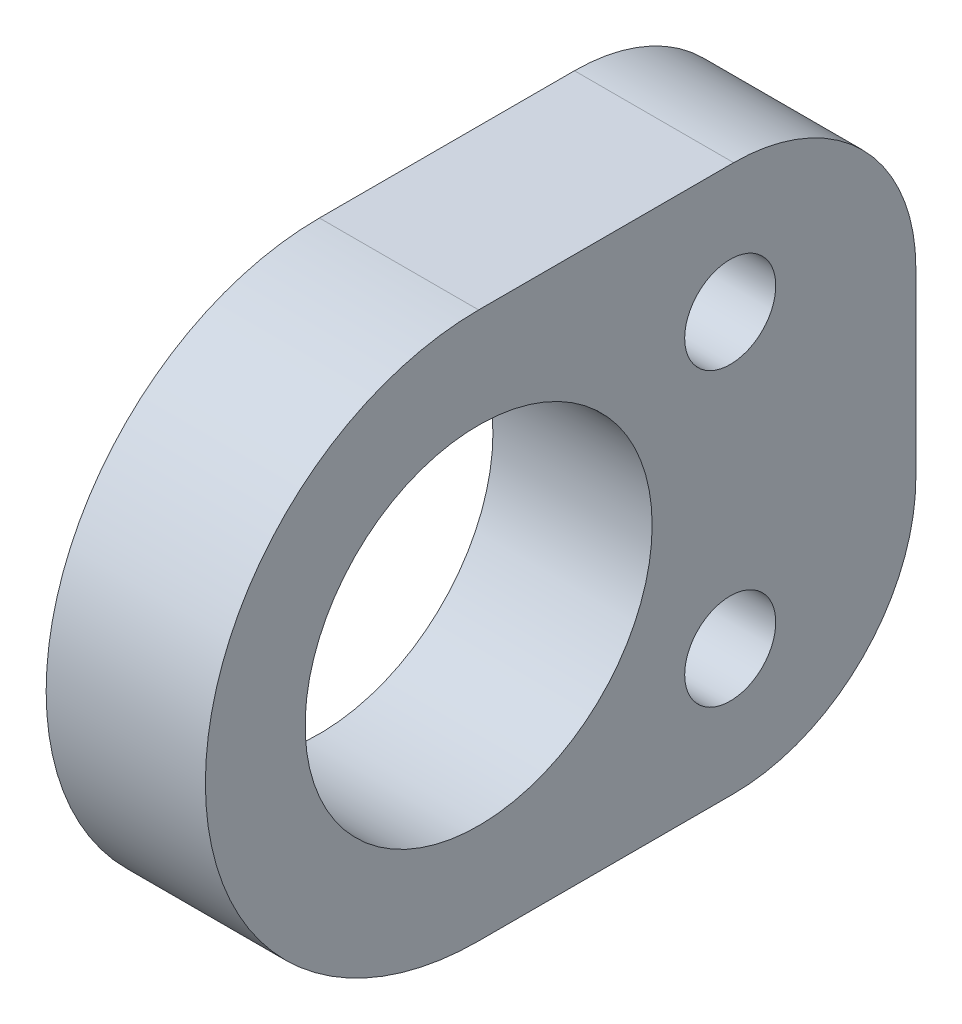
ISO-10303-21;
HEADER;
FILE_DESCRIPTION(('STEP AP214'),'2;1');
FILE_NAME('part.step','',(''),(''),'','','');
FILE_SCHEMA(('AUTOMOTIVE_DESIGN { 1 0 10303 214 1 1 1 1 }'));
ENDSEC;
DATA;
#1=APPLICATION_CONTEXT('core data for automotive mechanical design processes');
#2=APPLICATION_PROTOCOL_DEFINITION('international standard','automotive_design',2000,#1);
#3=PRODUCT_CONTEXT('',#1,'mechanical');
#4=PRODUCT('Part','Part','',(#3));
#5=PRODUCT_RELATED_PRODUCT_CATEGORY('part','',(#4));
#6=PRODUCT_DEFINITION_FORMATION('','',#4);
#7=PRODUCT_DEFINITION_CONTEXT('part definition',#1,'design');
#8=PRODUCT_DEFINITION('design','',#6,#7);
#9=PRODUCT_DEFINITION_SHAPE('','',#8);
#10=(LENGTH_UNIT() NAMED_UNIT(*) SI_UNIT(.MILLI.,.METRE.));
#11=(NAMED_UNIT(*) PLANE_ANGLE_UNIT() SI_UNIT($,.RADIAN.));
#12=(NAMED_UNIT(*) SI_UNIT($,.STERADIAN.) SOLID_ANGLE_UNIT());
#13=UNCERTAINTY_MEASURE_WITH_UNIT(LENGTH_MEASURE(1.E-05),#10,'distance_accuracy_value','');
#14=(GEOMETRIC_REPRESENTATION_CONTEXT(3) GLOBAL_UNCERTAINTY_ASSIGNED_CONTEXT((#13)) GLOBAL_UNIT_ASSIGNED_CONTEXT((#10,
#11,#12)) REPRESENTATION_CONTEXT('',''));
#15=CARTESIAN_POINT('',(0.,0.,0.));
#16=DIRECTION('',(0.,0.,1.));
#17=DIRECTION('',(1.,0.,0.));
#18=AXIS2_PLACEMENT_3D('',#15,#16,#17);
#19=CARTESIAN_POINT('',(4.37,0.,0.));
#20=DIRECTION('',(1.,0.,0.));
#21=DIRECTION('',(0.,0.,-1.));
#22=AXIS2_PLACEMENT_3D('',#19,#20,#21);
#23=PLANE('',#22);
#24=CARTESIAN_POINT('',(4.37,4.,-6.9050995648144));
#25=DIRECTION('',(-1.,0.,0.));
#26=DIRECTION('',(0.,0.,1.));
#27=AXIS2_PLACEMENT_3D('',#24,#25,#26);
#28=CIRCLE('',#27,1.25);
#29=CARTESIAN_POINT('',(4.37,4.,-5.6550995648144));
#30=VERTEX_POINT('',#29);
#31=EDGE_CURVE('E205',#30,#30,#28,.T.);
#32=ORIENTED_EDGE('',*,*,#31,.T.);
#33=EDGE_LOOP('',(#32));
#34=FACE_BOUND('',#33,.T.);
#35=CARTESIAN_POINT('',(4.37,-4.,-6.9050995648144));
#36=DIRECTION('',(-1.,0.,0.));
#37=DIRECTION('',(0.,0.,1.));
#38=AXIS2_PLACEMENT_3D('',#35,#36,#37);
#39=CIRCLE('',#38,1.25);
#40=CARTESIAN_POINT('',(4.37,-4.,-5.6550995648144));
#41=VERTEX_POINT('',#40);
#42=EDGE_CURVE('E194',#41,#41,#39,.T.);
#43=ORIENTED_EDGE('',*,*,#42,.T.);
#44=EDGE_LOOP('',(#43));
#45=FACE_BOUND('',#44,.T.);
#46=DIRECTION('',(0.,0.,1.));
#47=VECTOR('',#46,1.);
#48=CARTESIAN_POINT('',(4.37,-7.5,-12.));
#49=LINE('',#48,#47);
#50=CARTESIAN_POINT('',(4.37,-7.5,-7.));
#51=VERTEX_POINT('',#50);
#52=CARTESIAN_POINT('',(4.37,-7.5,0.));
#53=VERTEX_POINT('',#52);
#54=EDGE_CURVE('E117',#51,#53,#49,.T.);
#55=ORIENTED_EDGE('',*,*,#54,.F.);
#56=CARTESIAN_POINT('',(4.37,-2.5,-7.));
#57=DIRECTION('',(1.,0.,0.));
#58=DIRECTION('',(0.,0.,-1.));
#59=AXIS2_PLACEMENT_3D('',#56,#57,#58);
#60=CIRCLE('',#59,5.);
#61=CARTESIAN_POINT('',(4.37,-2.5,-12.));
#62=VERTEX_POINT('',#61);
#63=EDGE_CURVE('E71',#51,#62,#60,.T.);
#64=ORIENTED_EDGE('',*,*,#63,.T.);
#65=DIRECTION('',(0.,-1.,0.));
#66=VECTOR('',#65,1.);
#67=CARTESIAN_POINT('',(4.37,7.5,-12.));
#68=LINE('',#67,#66);
#69=CARTESIAN_POINT('',(4.37,2.5,-12.));
#70=VERTEX_POINT('',#69);
#71=EDGE_CURVE('E126',#70,#62,#68,.T.);
#72=ORIENTED_EDGE('',*,*,#71,.F.);
#73=CARTESIAN_POINT('',(4.37,2.5,-7.));
#74=DIRECTION('',(1.,0.,0.));
#75=DIRECTION('',(0.,0.,-1.));
#76=AXIS2_PLACEMENT_3D('',#73,#74,#75);
#77=CIRCLE('',#76,5.);
#78=CARTESIAN_POINT('',(4.37,7.5,-7.));
#79=VERTEX_POINT('',#78);
#80=EDGE_CURVE('E78',#70,#79,#77,.T.);
#81=ORIENTED_EDGE('',*,*,#80,.T.);
#82=DIRECTION('',(0.,0.,-1.));
#83=VECTOR('',#82,1.);
#84=CARTESIAN_POINT('',(4.37,7.5,0.));
#85=LINE('',#84,#83);
#86=CARTESIAN_POINT('',(4.37,7.5,0.));
#87=VERTEX_POINT('',#86);
#88=EDGE_CURVE('E130',#87,#79,#85,.T.);
#89=ORIENTED_EDGE('',*,*,#88,.F.);
#90=CARTESIAN_POINT('',(4.37,0.,0.));
#91=DIRECTION('',(1.,0.,0.));
#92=DIRECTION('',(0.,0.,-1.));
#93=AXIS2_PLACEMENT_3D('',#90,#91,#92);
#94=CIRCLE('',#93,7.5);
#95=EDGE_CURVE('E125',#87,#53,#94,.T.);
#96=ORIENTED_EDGE('',*,*,#95,.T.);
#97=EDGE_LOOP('',(#55,#64,#72,#81,#89,#96));
#98=FACE_BOUND('',#97,.T.);
#99=CARTESIAN_POINT('',(4.37,0.,0.));
#100=DIRECTION('',(1.,0.,0.));
#101=DIRECTION('',(0.,0.,-1.));
#102=AXIS2_PLACEMENT_3D('',#99,#100,#101);
#103=CIRCLE('',#102,4.7625);
#104=CARTESIAN_POINT('',(4.37,0.,-4.7625));
#105=VERTEX_POINT('',#104);
#106=EDGE_CURVE('E186',#105,#105,#103,.T.);
#107=ORIENTED_EDGE('',*,*,#106,.F.);
#108=EDGE_LOOP('',(#107));
#109=FACE_BOUND('',#108,.T.);
#110=ADVANCED_FACE('F62',(#34,#45,#98,#109),#23,.T.);
#111=CARTESIAN_POINT('',(0.,0.,0.));
#112=DIRECTION('',(1.,0.,0.));
#113=DIRECTION('',(0.,0.,-1.));
#114=AXIS2_PLACEMENT_3D('',#111,#112,#113);
#115=PLANE('',#114);
#116=CARTESIAN_POINT('',(0.,4.,-6.9050995648144));
#117=DIRECTION('',(-1.,0.,0.));
#118=DIRECTION('',(0.,0.,1.));
#119=AXIS2_PLACEMENT_3D('',#116,#117,#118);
#120=CIRCLE('',#119,1.24999999999999);
#121=CARTESIAN_POINT('',(0.,4.,-5.65509956481441));
#122=VERTEX_POINT('',#121);
#123=EDGE_CURVE('E209',#122,#122,#120,.T.);
#124=ORIENTED_EDGE('',*,*,#123,.F.);
#125=EDGE_LOOP('',(#124));
#126=FACE_BOUND('',#125,.T.);
#127=CARTESIAN_POINT('',(0.,-4.,-6.9050995648144));
#128=DIRECTION('',(-1.,0.,0.));
#129=DIRECTION('',(0.,0.,1.));
#130=AXIS2_PLACEMENT_3D('',#127,#128,#129);
#131=CIRCLE('',#130,1.24999999999999);
#132=CARTESIAN_POINT('',(0.,-4.,-5.65509956481441));
#133=VERTEX_POINT('',#132);
#134=EDGE_CURVE('E201',#133,#133,#131,.T.);
#135=ORIENTED_EDGE('',*,*,#134,.F.);
#136=EDGE_LOOP('',(#135));
#137=FACE_BOUND('',#136,.T.);
#138=DIRECTION('',(0.,-1.,0.));
#139=VECTOR('',#138,1.);
#140=CARTESIAN_POINT('',(0.,7.5,-12.));
#141=LINE('',#140,#139);
#142=CARTESIAN_POINT('',(0.,2.5,-12.));
#143=VERTEX_POINT('',#142);
#144=CARTESIAN_POINT('',(0.,-2.5,-12.));
#145=VERTEX_POINT('',#144);
#146=EDGE_CURVE('E176',#143,#145,#141,.T.);
#147=ORIENTED_EDGE('',*,*,#146,.T.);
#148=CARTESIAN_POINT('',(0.,-2.5,-7.));
#149=DIRECTION('',(1.,0.,0.));
#150=DIRECTION('',(0.,0.,-1.));
#151=AXIS2_PLACEMENT_3D('',#148,#149,#150);
#152=CIRCLE('',#151,5.);
#153=CARTESIAN_POINT('',(0.,-7.5,-7.));
#154=VERTEX_POINT('',#153);
#155=EDGE_CURVE('E154',#145,#154,#152,.F.);
#156=ORIENTED_EDGE('',*,*,#155,.T.);
#157=DIRECTION('',(0.,0.,1.));
#158=VECTOR('',#157,1.);
#159=CARTESIAN_POINT('',(0.,-7.5,-12.));
#160=LINE('',#159,#158);
#161=CARTESIAN_POINT('',(0.,-7.5,0.));
#162=VERTEX_POINT('',#161);
#163=EDGE_CURVE('E175',#154,#162,#160,.T.);
#164=ORIENTED_EDGE('',*,*,#163,.T.);
#165=CARTESIAN_POINT('',(0.,0.,0.));
#166=DIRECTION('',(1.,0.,0.));
#167=DIRECTION('',(0.,0.,-1.));
#168=AXIS2_PLACEMENT_3D('',#165,#166,#167);
#169=CIRCLE('',#168,7.5);
#170=CARTESIAN_POINT('',(0.,7.5,0.));
#171=VERTEX_POINT('',#170);
#172=EDGE_CURVE('E136',#171,#162,#169,.T.);
#173=ORIENTED_EDGE('',*,*,#172,.F.);
#174=DIRECTION('',(0.,0.,-1.));
#175=VECTOR('',#174,1.);
#176=CARTESIAN_POINT('',(0.,7.5,0.));
#177=LINE('',#176,#175);
#178=CARTESIAN_POINT('',(0.,7.5,-7.));
#179=VERTEX_POINT('',#178);
#180=EDGE_CURVE('E181',#171,#179,#177,.T.);
#181=ORIENTED_EDGE('',*,*,#180,.T.);
#182=CARTESIAN_POINT('',(0.,2.5,-7.));
#183=DIRECTION('',(1.,0.,0.));
#184=DIRECTION('',(0.,0.,-1.));
#185=AXIS2_PLACEMENT_3D('',#182,#183,#184);
#186=CIRCLE('',#185,5.);
#187=EDGE_CURVE('E151',#179,#143,#186,.F.);
#188=ORIENTED_EDGE('',*,*,#187,.T.);
#189=EDGE_LOOP('',(#147,#156,#164,#173,#181,#188));
#190=FACE_BOUND('',#189,.T.);
#191=CARTESIAN_POINT('',(0.,0.,0.));
#192=DIRECTION('',(1.,0.,0.));
#193=DIRECTION('',(0.,0.,-1.));
#194=AXIS2_PLACEMENT_3D('',#191,#192,#193);
#195=CIRCLE('',#194,4.7625);
#196=CARTESIAN_POINT('',(0.,0.,-4.7625));
#197=VERTEX_POINT('',#196);
#198=EDGE_CURVE('E190',#197,#197,#195,.T.);
#199=ORIENTED_EDGE('',*,*,#198,.T.);
#200=EDGE_LOOP('',(#199));
#201=FACE_BOUND('',#200,.T.);
#202=ADVANCED_FACE('F173',(#126,#137,#190,#201),#115,.F.);
#203=CARTESIAN_POINT('',(4.37,7.5,0.));
#204=DIRECTION('',(0.,1.,0.));
#205=DIRECTION('',(0.,0.,1.));
#206=AXIS2_PLACEMENT_3D('',#203,#204,#205);
#207=PLANE('',#206);
#208=ORIENTED_EDGE('',*,*,#88,.T.);
#209=DIRECTION('',(-1.,0.,0.));
#210=VECTOR('',#209,1.);
#211=CARTESIAN_POINT('',(4.37,7.5,-7.));
#212=LINE('',#211,#210);
#213=EDGE_CURVE('E12',#79,#179,#212,.T.);
#214=ORIENTED_EDGE('',*,*,#213,.T.);
#215=ORIENTED_EDGE('',*,*,#180,.F.);
#216=DIRECTION('',(-1.,0.,0.));
#217=VECTOR('',#216,1.);
#218=CARTESIAN_POINT('',(4.37,7.5,0.));
#219=LINE('',#218,#217);
#220=EDGE_CURVE('E138',#87,#171,#219,.T.);
#221=ORIENTED_EDGE('',*,*,#220,.F.);
#222=EDGE_LOOP('',(#208,#214,#215,#221));
#223=FACE_BOUND('',#222,.T.);
#224=ADVANCED_FACE('F218',(#223),#207,.T.);
#225=CARTESIAN_POINT('',(4.37,0.,0.));
#226=DIRECTION('',(-1.,0.,0.));
#227=DIRECTION('',(0.,0.,1.));
#228=AXIS2_PLACEMENT_3D('',#225,#226,#227);
#229=CYLINDRICAL_SURFACE('',#228,7.5);
#230=ORIENTED_EDGE('',*,*,#172,.T.);
#231=DIRECTION('',(-1.,0.,0.));
#232=VECTOR('',#231,1.);
#233=CARTESIAN_POINT('',(4.37,-7.5,0.));
#234=LINE('',#233,#232);
#235=EDGE_CURVE('E121',#53,#162,#234,.T.);
#236=ORIENTED_EDGE('',*,*,#235,.F.);
#237=ORIENTED_EDGE('',*,*,#95,.F.);
#238=ORIENTED_EDGE('',*,*,#220,.T.);
#239=EDGE_LOOP('',(#230,#236,#237,#238));
#240=FACE_BOUND('',#239,.T.);
#241=ADVANCED_FACE('F134',(#240),#229,.T.);
#242=CARTESIAN_POINT('',(4.37,-7.5,-12.));
#243=DIRECTION('',(0.,-1.,0.));
#244=DIRECTION('',(0.,0.,-1.));
#245=AXIS2_PLACEMENT_3D('',#242,#243,#244);
#246=PLANE('',#245);
#247=ORIENTED_EDGE('',*,*,#163,.F.);
#248=DIRECTION('',(-1.,0.,0.));
#249=VECTOR('',#248,1.);
#250=CARTESIAN_POINT('',(4.37,-7.5,-7.));
#251=LINE('',#250,#249);
#252=EDGE_CURVE('E86',#154,#51,#251,.F.);
#253=ORIENTED_EDGE('',*,*,#252,.T.);
#254=ORIENTED_EDGE('',*,*,#54,.T.);
#255=ORIENTED_EDGE('',*,*,#235,.T.);
#256=EDGE_LOOP('',(#247,#253,#254,#255));
#257=FACE_BOUND('',#256,.T.);
#258=ADVANCED_FACE('F119',(#257),#246,.T.);
#259=CARTESIAN_POINT('',(4.37,7.5,-12.));
#260=DIRECTION('',(0.,0.,-1.));
#261=DIRECTION('',(-1.,0.,0.));
#262=AXIS2_PLACEMENT_3D('',#259,#260,#261);
#263=PLANE('',#262);
#264=ORIENTED_EDGE('',*,*,#71,.T.);
#265=DIRECTION('',(-1.,0.,0.));
#266=VECTOR('',#265,1.);
#267=CARTESIAN_POINT('',(4.37,-2.5,-12.));
#268=LINE('',#267,#266);
#269=EDGE_CURVE('E147',#62,#145,#268,.T.);
#270=ORIENTED_EDGE('',*,*,#269,.T.);
#271=ORIENTED_EDGE('',*,*,#146,.F.);
#272=DIRECTION('',(-1.,0.,0.));
#273=VECTOR('',#272,1.);
#274=CARTESIAN_POINT('',(4.37,2.5,-12.));
#275=LINE('',#274,#273);
#276=EDGE_CURVE('E141',#143,#70,#275,.F.);
#277=ORIENTED_EDGE('',*,*,#276,.T.);
#278=EDGE_LOOP('',(#264,#270,#271,#277));
#279=FACE_BOUND('',#278,.T.);
#280=ADVANCED_FACE('F165',(#279),#263,.T.);
#281=CARTESIAN_POINT('',(4.37,0.,0.));
#282=DIRECTION('',(-1.,0.,0.));
#283=DIRECTION('',(0.,0.,1.));
#284=AXIS2_PLACEMENT_3D('',#281,#282,#283);
#285=CYLINDRICAL_SURFACE('',#284,4.7625);
#286=ORIENTED_EDGE('',*,*,#106,.T.);
#287=EDGE_LOOP('',(#286));
#288=FACE_BOUND('',#287,.T.);
#289=ORIENTED_EDGE('',*,*,#198,.F.);
#290=EDGE_LOOP('',(#289));
#291=FACE_BOUND('',#290,.T.);
#292=ADVANCED_FACE('F242',(#288,#291),#285,.F.);
#293=CARTESIAN_POINT('',(4.37,-2.5,-7.));
#294=DIRECTION('',(-1.,0.,0.));
#295=DIRECTION('',(0.,0.,1.));
#296=AXIS2_PLACEMENT_3D('',#293,#294,#295);
#297=CYLINDRICAL_SURFACE('',#296,5.);
#298=ORIENTED_EDGE('',*,*,#63,.F.);
#299=ORIENTED_EDGE('',*,*,#252,.F.);
#300=ORIENTED_EDGE('',*,*,#155,.F.);
#301=ORIENTED_EDGE('',*,*,#269,.F.);
#302=EDGE_LOOP('',(#298,#299,#300,#301));
#303=FACE_BOUND('',#302,.T.);
#304=ADVANCED_FACE('F171',(#303),#297,.T.);
#305=CARTESIAN_POINT('',(4.37,2.5,-7.));
#306=DIRECTION('',(-1.,0.,0.));
#307=DIRECTION('',(0.,0.,1.));
#308=AXIS2_PLACEMENT_3D('',#305,#306,#307);
#309=CYLINDRICAL_SURFACE('',#308,5.);
#310=ORIENTED_EDGE('',*,*,#80,.F.);
#311=ORIENTED_EDGE('',*,*,#276,.F.);
#312=ORIENTED_EDGE('',*,*,#187,.F.);
#313=ORIENTED_EDGE('',*,*,#213,.F.);
#314=EDGE_LOOP('',(#310,#311,#312,#313));
#315=FACE_BOUND('',#314,.T.);
#316=ADVANCED_FACE('F64',(#315),#309,.T.);
#317=CARTESIAN_POINT('',(0.,-4.,-6.9050995648144));
#318=DIRECTION('',(-1.,0.,0.));
#319=DIRECTION('',(0.,0.,1.));
#320=AXIS2_PLACEMENT_3D('',#317,#318,#319);
#321=CYLINDRICAL_SURFACE('',#320,1.24999999999999);
#322=ORIENTED_EDGE('',*,*,#42,.F.);
#323=EDGE_LOOP('',(#322));
#324=FACE_BOUND('',#323,.T.);
#325=ORIENTED_EDGE('',*,*,#134,.T.);
#326=EDGE_LOOP('',(#325));
#327=FACE_BOUND('',#326,.T.);
#328=ADVANCED_FACE('F222',(#324,#327),#321,.F.);
#329=CARTESIAN_POINT('',(0.,4.,-6.9050995648144));
#330=DIRECTION('',(-1.,0.,0.));
#331=DIRECTION('',(0.,0.,1.));
#332=AXIS2_PLACEMENT_3D('',#329,#330,#331);
#333=CYLINDRICAL_SURFACE('',#332,1.24999999999999);
#334=ORIENTED_EDGE('',*,*,#31,.F.);
#335=EDGE_LOOP('',(#334));
#336=FACE_BOUND('',#335,.T.);
#337=ORIENTED_EDGE('',*,*,#123,.T.);
#338=EDGE_LOOP('',(#337));
#339=FACE_BOUND('',#338,.T.);
#340=ADVANCED_FACE('F214',(#336,#339),#333,.F.);
#341=CLOSED_SHELL('',(#110,#202,#224,#241,#258,#280,#292,#304,#316,#328,#340));
#342=MANIFOLD_SOLID_BREP('B2',#341);
#343=ADVANCED_BREP_SHAPE_REPRESENTATION('',(#18,#342),#14);
#344=SHAPE_DEFINITION_REPRESENTATION(#9,#343);
ENDSEC;
END-ISO-10303-21;
